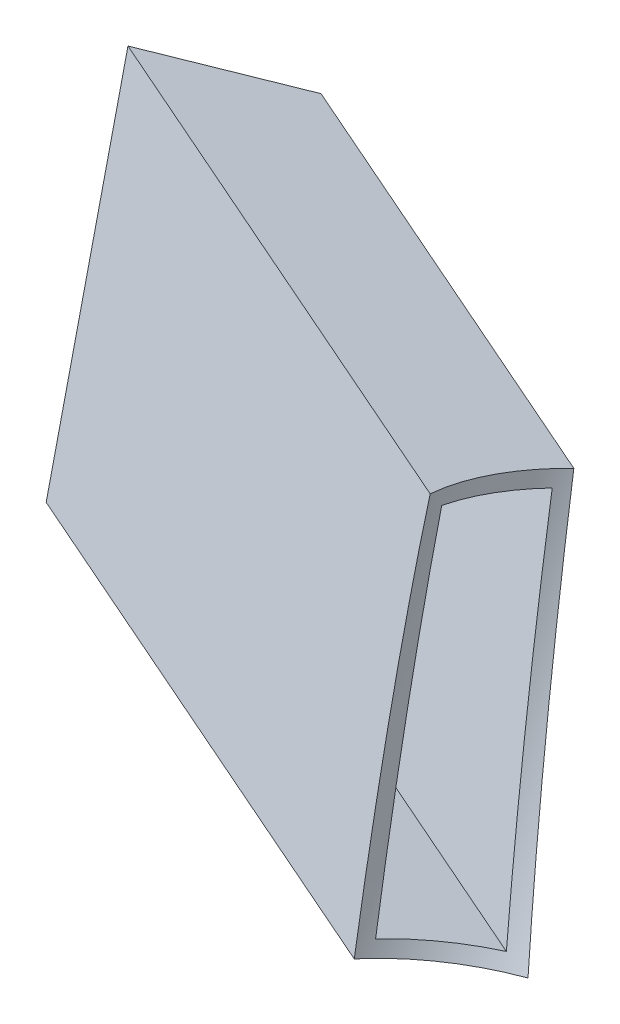
ISO-10303-21;
HEADER;
FILE_DESCRIPTION(('STEP AP214'),'2;1');
FILE_NAME('part.step','',(''),(''),'','','');
FILE_SCHEMA(('AUTOMOTIVE_DESIGN { 1 0 10303 214 1 1 1 1 }'));
ENDSEC;
DATA;
#1=APPLICATION_CONTEXT('core data for automotive mechanical design processes');
#2=APPLICATION_PROTOCOL_DEFINITION('international standard','automotive_design',2000,#1);
#3=PRODUCT_CONTEXT('',#1,'mechanical');
#4=PRODUCT('Part','Part','',(#3));
#5=PRODUCT_RELATED_PRODUCT_CATEGORY('part','',(#4));
#6=PRODUCT_DEFINITION_FORMATION('','',#4);
#7=PRODUCT_DEFINITION_CONTEXT('part definition',#1,'design');
#8=PRODUCT_DEFINITION('design','',#6,#7);
#9=PRODUCT_DEFINITION_SHAPE('','',#8);
#10=(LENGTH_UNIT() NAMED_UNIT(*) SI_UNIT(.MILLI.,.METRE.));
#11=(NAMED_UNIT(*) PLANE_ANGLE_UNIT() SI_UNIT($,.RADIAN.));
#12=(NAMED_UNIT(*) SI_UNIT($,.STERADIAN.) SOLID_ANGLE_UNIT());
#13=UNCERTAINTY_MEASURE_WITH_UNIT(LENGTH_MEASURE(1.E-05),#10,'distance_accuracy_value','');
#14=(GEOMETRIC_REPRESENTATION_CONTEXT(3) GLOBAL_UNCERTAINTY_ASSIGNED_CONTEXT((#13)) GLOBAL_UNIT_ASSIGNED_CONTEXT((#10,
#11,#12)) REPRESENTATION_CONTEXT('',''));
#15=CARTESIAN_POINT('',(0.,0.,0.));
#16=DIRECTION('',(0.,0.,1.));
#17=DIRECTION('',(1.,0.,0.));
#18=AXIS2_PLACEMENT_3D('',#15,#16,#17);
#19=CARTESIAN_POINT('',(-152.700000000018,493.150380334973,267.608142586965));
#20=DIRECTION('',(-0.519686820333577,-0.192188471774973,-0.832459728808773));
#21=DIRECTION('',(-0.848273208946956,0.,0.529558838074519));
#22=AXIS2_PLACEMENT_3D('',#19,#20,#21);
#23=PLANE('',#22);
#24=DIRECTION('',(-0.85435683924902,0.116904098162656,0.506367280796459));
#25=VECTOR('',#24,1.);
#26=CARTESIAN_POINT('',(-69.3047580241468,447.585550535437,226.065744882013));
#27=LINE('',#26,#25);
#28=CARTESIAN_POINT('',(-143.048000000018,457.676049964642,269.77249971909));
#29=VERTEX_POINT('',#28);
#30=CARTESIAN_POINT('',(-162.352000000018,460.317471683599,281.213754168563));
#31=VERTEX_POINT('',#30);
#32=EDGE_CURVE('E49',#29,#31,#27,.T.);
#33=ORIENTED_EDGE('',*,*,#32,.F.);
#34=DIRECTION('',(0.,-0.974370064785232,0.224951054343881));
#35=VECTOR('',#34,1.);
#36=CARTESIAN_POINT('',(-143.048000000018,525.983288986346,254.002531005367));
#37=LINE('',#36,#35);
#38=CARTESIAN_POINT('',(-143.048000000018,525.983288986346,254.002531005367));
#39=VERTEX_POINT('',#38);
#40=EDGE_CURVE('E92',#39,#29,#37,.T.);
#41=ORIENTED_EDGE('',*,*,#40,.F.);
#42=DIRECTION('',(0.85435683924902,-0.116904098162656,-0.506367280796459));
#43=VECTOR('',#42,1.);
#44=CARTESIAN_POINT('',(-69.3047580241468,515.892789557141,210.295776168289));
#45=LINE('',#44,#43);
#46=CARTESIAN_POINT('',(-162.352000000019,528.624710705303,265.443785454839));
#47=VERTEX_POINT('',#46);
#48=EDGE_CURVE('E120',#47,#39,#45,.T.);
#49=ORIENTED_EDGE('',*,*,#48,.F.);
#50=DIRECTION('',(0.,0.974370064785232,-0.224951054343881));
#51=VECTOR('',#50,1.);
#52=CARTESIAN_POINT('',(-162.352000000019,528.624710705303,265.443785454839));
#53=LINE('',#52,#51);
#54=EDGE_CURVE('E99',#31,#47,#53,.T.);
#55=ORIENTED_EDGE('',*,*,#54,.F.);
#56=EDGE_LOOP('',(#33,#41,#49,#55));
#57=FACE_BOUND('',#56,.T.);
#58=DIRECTION('',(0.,0.974370064785232,-0.224951054343881));
#59=VECTOR('',#58,1.);
#60=CARTESIAN_POINT('',(-165.400000000019,532.011657249972,266.564648501642));
#61=LINE('',#60,#59);
#62=CARTESIAN_POINT('',(-165.400000000018,457.764658313338,283.705918842646));
#63=VERTEX_POINT('',#62);
#64=CARTESIAN_POINT('',(-165.400000000019,532.011657249972,266.564648501642));
#65=VERTEX_POINT('',#64);
#66=EDGE_CURVE('E160',#63,#65,#61,.T.);
#67=ORIENTED_EDGE('',*,*,#66,.T.);
#68=DIRECTION('',(0.85435683924902,-0.116904098162656,-0.506367280796459));
#69=VECTOR('',#68,1.);
#70=CARTESIAN_POINT('',(-67.0799447686111,518.558241932043,208.291504625311));
#71=LINE('',#70,#69);
#72=CARTESIAN_POINT('',(-140.000000000018,528.536102356608,251.510366331284));
#73=VERTEX_POINT('',#72);
#74=EDGE_CURVE('E158',#65,#73,#71,.T.);
#75=ORIENTED_EDGE('',*,*,#74,.T.);
#76=DIRECTION('',(0.,-0.974370064785232,0.224951054343881));
#77=VECTOR('',#76,1.);
#78=CARTESIAN_POINT('',(-140.000000000018,528.536102356608,251.510366331284));
#79=LINE('',#78,#77);
#80=CARTESIAN_POINT('',(-140.000000000018,454.289103419973,268.651636672287));
#81=VERTEX_POINT('',#80);
#82=EDGE_CURVE('E156',#73,#81,#79,.T.);
#83=ORIENTED_EDGE('',*,*,#82,.T.);
#84=DIRECTION('',(-0.85435683924902,0.116904098162656,0.506367280796459));
#85=VECTOR('',#84,1.);
#86=CARTESIAN_POINT('',(-67.079944768611,444.311242995409,225.432774966315));
#87=LINE('',#86,#85);
#88=EDGE_CURVE('E132',#81,#63,#87,.T.);
#89=ORIENTED_EDGE('',*,*,#88,.T.);
#90=EDGE_LOOP('',(#67,#75,#83,#89));
#91=FACE_BOUND('',#90,.T.);
#92=ADVANCED_FACE('F40',(#57,#91),#23,.T.);
#93=CARTESIAN_POINT('',(-5.84011046280296,550.599033998661,347.075422454812));
#94=DIRECTION('',(0.459851217543135,-0.199755631603012,-0.865236699040776));
#95=DIRECTION('',(-0.88303358136935,0.,-0.469309806177135));
#96=AXIS2_PLACEMENT_3D('',#93,#94,#95);
#97=PLANE('',#96);
#98=ORIENTED_EDGE('',*,*,#66,.F.);
#99=DIRECTION('',(-0.887995978439146,-0.103444016227646,-0.448065260629072));
#100=VECTOR('',#99,1.);
#101=CARTESIAN_POINT('',(-5.8401104628029,476.352035062027,364.216692795816));
#102=LINE('',#101,#100);
#103=CARTESIAN_POINT('',(-35.0909450628458,472.944560385894,349.457298443914));
#104=VERTEX_POINT('',#103);
#105=EDGE_CURVE('E131',#104,#63,#102,.T.);
#106=ORIENTED_EDGE('',*,*,#105,.F.);
#107=CARTESIAN_POINT('',(-5.5649929109336E-12,468.575510617686,369.115914550578));
#108=DIRECTION('',(0.459851217543135,-0.199755631603012,-0.865236699040776));
#109=DIRECTION('',(-0.123628089728877,0.950479313784053,-0.285140613555112));
#110=AXIS2_PLACEMENT_3D('',#107,#108,#109);
#111=ELLIPSE('',#110,146.750178018489,38.1);
#112=CARTESIAN_POINT('',(-37.5922025299541,546.900183996177,331.053942906455));
#113=VERTEX_POINT('',#112);
#114=EDGE_CURVE('E142',#113,#104,#111,.F.);
#115=ORIENTED_EDGE('',*,*,#114,.F.);
#116=DIRECTION('',(-0.887995978439146,-0.103444016227646,-0.448065260629072));
#117=VECTOR('',#116,1.);
#118=CARTESIAN_POINT('',(-5.84011046280296,550.599033998661,347.075422454812));
#119=LINE('',#118,#117);
#120=EDGE_CURVE('E129',#113,#65,#119,.T.);
#121=ORIENTED_EDGE('',*,*,#120,.T.);
#122=EDGE_LOOP('',(#98,#106,#115,#121));
#123=FACE_BOUND('',#122,.T.);
#124=ADVANCED_FACE('F174',(#123),#97,.F.);
#125=CARTESIAN_POINT('',(5.84011046279274,471.27824201931,342.23968064018));
#126=DIRECTION('',(0.,0.974370064785232,-0.224951054343881));
#127=DIRECTION('',(0.,0.224951054343881,0.974370064785232));
#128=AXIS2_PLACEMENT_3D('',#125,#126,#127);
#129=PLANE('',#128);
#130=ORIENTED_EDGE('',*,*,#88,.F.);
#131=DIRECTION('',(-0.887995978439146,-0.103444016227646,-0.448065260629072));
#132=VECTOR('',#131,1.);
#133=CARTESIAN_POINT('',(5.84011046279274,471.27824201931,342.23968064018));
#134=LINE('',#133,#132);
#135=CARTESIAN_POINT('',(-17.8537114720443,468.518112288734,330.284245302295));
#136=VERTEX_POINT('',#135);
#137=EDGE_CURVE('E134',#136,#81,#134,.T.);
#138=ORIENTED_EDGE('',*,*,#137,.F.);
#139=CARTESIAN_POINT('',(-5.48172618408671E-12,476.43544467188,364.577979508577));
#140=DIRECTION('',(0.,0.974370064785232,-0.224951054343881));
#141=DIRECTION('',(0.,-0.224951054343881,-0.974370064785232));
#142=AXIS2_PLACEMENT_3D('',#139,#140,#141);
#143=ELLIPSE('',#142,39.8408559221603,38.1);
#144=EDGE_CURVE('E147',#104,#136,#143,.F.);
#145=ORIENTED_EDGE('',*,*,#144,.F.);
#146=ORIENTED_EDGE('',*,*,#105,.T.);
#147=EDGE_LOOP('',(#130,#138,#145,#146));
#148=FACE_BOUND('',#147,.T.);
#149=ADVANCED_FACE('F179',(#148),#129,.F.);
#150=CARTESIAN_POINT('',(5.84011046279269,545.525240955945,325.098410299177));
#151=DIRECTION('',(-0.459851217543135,0.199755631603012,0.865236699040776));
#152=DIRECTION('',(0.88303358136935,0.,0.469309806177135));
#153=AXIS2_PLACEMENT_3D('',#150,#151,#152);
#154=PLANE('',#153);
#155=ORIENTED_EDGE('',*,*,#82,.F.);
#156=DIRECTION('',(-0.887995978439146,-0.103444016227646,-0.448065260629072));
#157=VECTOR('',#156,1.);
#158=CARTESIAN_POINT('',(5.84011046279269,545.525240955945,325.098410299177));
#159=LINE('',#158,#157);
#160=CARTESIAN_POINT('',(-33.0725937670595,540.99224023798,305.463827051201));
#161=VERTEX_POINT('',#160);
#162=EDGE_CURVE('E43',#161,#73,#159,.T.);
#163=ORIENTED_EDGE('',*,*,#162,.F.);
#164=CARTESIAN_POINT('',(-4.81559236931162E-12,553.301765400285,320.199188544414));
#165=DIRECTION('',(-0.459851217543135,0.199755631603012,0.865236699040776));
#166=DIRECTION('',(-0.123628089728877,0.950479313784053,-0.285140613555112));
#167=AXIS2_PLACEMENT_3D('',#164,#165,#166);
#168=ELLIPSE('',#167,146.750178018489,38.1);
#169=EDGE_CURVE('E150',#136,#161,#168,.F.);
#170=ORIENTED_EDGE('',*,*,#169,.F.);
#171=ORIENTED_EDGE('',*,*,#137,.T.);
#172=EDGE_LOOP('',(#155,#163,#170,#171));
#173=FACE_BOUND('',#172,.T.);
#174=ADVANCED_FACE('F169',(#173),#154,.F.);
#175=CARTESIAN_POINT('',(5.84011046279269,545.525240955945,325.098410299177));
#176=DIRECTION('',(0.,-0.974370064785232,0.224951054343881));
#177=DIRECTION('',(0.,-0.224951054343881,-0.974370064785232));
#178=AXIS2_PLACEMENT_3D('',#175,#176,#177);
#179=PLANE('',#178);
#180=ORIENTED_EDGE('',*,*,#74,.F.);
#181=ORIENTED_EDGE('',*,*,#120,.F.);
#182=CARTESIAN_POINT('',(-4.8988590961585E-12,545.441831346092,324.737123586416));
#183=DIRECTION('',(0.,-0.974370064785232,0.224951054343881));
#184=DIRECTION('',(0.,-0.224951054343881,-0.974370064785232));
#185=AXIS2_PLACEMENT_3D('',#182,#183,#184);
#186=ELLIPSE('',#185,39.8408559221603,38.1);
#187=EDGE_CURVE('E58',#161,#113,#186,.F.);
#188=ORIENTED_EDGE('',*,*,#187,.F.);
#189=ORIENTED_EDGE('',*,*,#162,.T.);
#190=EDGE_LOOP('',(#180,#181,#188,#189));
#191=FACE_BOUND('',#190,.T.);
#192=ADVANCED_FACE('F171',(#191),#179,.F.);
#193=CARTESIAN_POINT('',(-6.28663787693995E-12,383.632903652674,418.157551547498));
#194=DIRECTION('',(0.,0.866025403784432,-0.500000000000012));
#195=DIRECTION('',(0.,0.500000000000012,0.866025403784432));
#196=AXIS2_PLACEMENT_3D('',#193,#194,#195);
#197=CYLINDRICAL_SURFACE('',#196,38.1);
#198=CARTESIAN_POINT('',(-4.91273688396632E-12,542.681575879123,326.330757823302));
#199=DIRECTION('',(0.,-0.974370064785232,0.22495105434388));
#200=DIRECTION('',(0.,-0.22495105434388,-0.974370064785232));
#201=AXIS2_PLACEMENT_3D('',#198,#199,#200);
#202=ELLIPSE('',#201,39.8408559221603,38.1);
#203=CARTESIAN_POINT('',(-34.0842673910673,538.676641656746,308.983481860981));
#204=VERTEX_POINT('',#203);
#205=CARTESIAN_POINT('',(-38.0576654461079,543.103948756808,328.160255752944));
#206=VERTEX_POINT('',#205);
#207=EDGE_CURVE('E117',#204,#206,#202,.F.);
#208=ORIENTED_EDGE('',*,*,#207,.F.);
#209=CARTESIAN_POINT('',(-4.91273688396632E-12,543.134614826374,326.069195665154));
#210=DIRECTION('',(-0.459851217543135,0.199755631603011,0.865236699040776));
#211=DIRECTION('',(-0.123628089728877,0.950479313784053,-0.285140613555112));
#212=AXIS2_PLACEMENT_3D('',#209,#210,#211);
#213=ELLIPSE('',#212,146.750178018489,38.1);
#214=CARTESIAN_POINT('',(-21.6388010611266,471.819194134389,331.033187476866));
#215=VERTEX_POINT('',#214);
#216=EDGE_CURVE('E109',#215,#204,#213,.F.);
#217=ORIENTED_EDGE('',*,*,#216,.F.);
#218=CARTESIAN_POINT('',(-5.48172618408671E-12,479.195700138848,362.98434527169));
#219=DIRECTION('',(0.,0.974370064785232,-0.22495105434388));
#220=DIRECTION('',(0.,-0.22495105434388,-0.974370064785232));
#221=AXIS2_PLACEMENT_3D('',#218,#219,#220);
#222=ELLIPSE('',#221,39.8408559221603,38.1);
#223=CARTESIAN_POINT('',(-34.200603194895,475.246024844399,345.876422022528));
#224=VERTEX_POINT('',#223);
#225=EDGE_CURVE('E11',#224,#215,#222,.F.);
#226=ORIENTED_EDGE('',*,*,#225,.F.);
#227=CARTESIAN_POINT('',(-5.4678483962789E-12,478.742661191598,363.245907429839));
#228=DIRECTION('',(0.459851217543135,-0.199755631603011,-0.865236699040776));
#229=DIRECTION('',(-0.123628089728877,0.950479313784053,-0.285140613555112));
#230=AXIS2_PLACEMENT_3D('',#227,#228,#229);
#231=ELLIPSE('',#230,146.750178018489,38.1);
#232=EDGE_CURVE('E127',#206,#224,#231,.F.);
#233=ORIENTED_EDGE('',*,*,#232,.F.);
#234=EDGE_LOOP('',(#208,#217,#226,#233));
#235=FACE_BOUND('',#234,.T.);
#236=ORIENTED_EDGE('',*,*,#114,.T.);
#237=ORIENTED_EDGE('',*,*,#144,.T.);
#238=ORIENTED_EDGE('',*,*,#169,.T.);
#239=ORIENTED_EDGE('',*,*,#187,.T.);
#240=EDGE_LOOP('',(#236,#237,#238,#239));
#241=FACE_BOUND('',#240,.T.);
#242=ADVANCED_FACE('F168',(#235,#241),#197,.F.);
#243=CARTESIAN_POINT('',(-4.43848395173148,547.02029887607,345.123831809776));
#244=DIRECTION('',(0.459851217543135,-0.199755631603011,-0.865236699040776));
#245=DIRECTION('',(-0.88303358136935,0.,-0.469309806177135));
#246=AXIS2_PLACEMENT_3D('',#243,#244,#245);
#247=PLANE('',#246);
#248=DIRECTION('',(-0.887995978439146,-0.103444016227646,-0.448065260629072));
#249=VECTOR('',#248,1.);
#250=CARTESIAN_POINT('',(-4.43848395173139,478.713059854366,360.8938005235));
#251=LINE('',#250,#249);
#252=EDGE_CURVE('E123',#224,#31,#251,.T.);
#253=ORIENTED_EDGE('',*,*,#252,.T.);
#254=ORIENTED_EDGE('',*,*,#54,.T.);
#255=DIRECTION('',(-0.887995978439146,-0.103444016227646,-0.448065260629072));
#256=VECTOR('',#255,1.);
#257=CARTESIAN_POINT('',(-4.43848395173148,547.02029887607,345.123831809776));
#258=LINE('',#257,#256);
#259=EDGE_CURVE('E125',#206,#47,#258,.T.);
#260=ORIENTED_EDGE('',*,*,#259,.F.);
#261=ORIENTED_EDGE('',*,*,#232,.T.);
#262=EDGE_LOOP('',(#253,#254,#260,#261));
#263=FACE_BOUND('',#262,.T.);
#264=ADVANCED_FACE('F188',(#263),#247,.T.);
#265=CARTESIAN_POINT('',(4.43848395172119,543.164216163605,328.421302571493));
#266=DIRECTION('',(0.,-0.974370064785232,0.22495105434388));
#267=DIRECTION('',(0.,-0.22495105434388,-0.974370064785232));
#268=AXIS2_PLACEMENT_3D('',#265,#266,#267);
#269=PLANE('',#268);
#270=ORIENTED_EDGE('',*,*,#259,.T.);
#271=ORIENTED_EDGE('',*,*,#48,.T.);
#272=DIRECTION('',(-0.887995978439146,-0.103444016227646,-0.448065260629072));
#273=VECTOR('',#272,1.);
#274=CARTESIAN_POINT('',(4.43848395172119,543.164216163605,328.421302571493));
#275=LINE('',#274,#273);
#276=EDGE_CURVE('E113',#204,#39,#275,.T.);
#277=ORIENTED_EDGE('',*,*,#276,.F.);
#278=ORIENTED_EDGE('',*,*,#207,.T.);
#279=EDGE_LOOP('',(#270,#271,#277,#278));
#280=FACE_BOUND('',#279,.T.);
#281=ADVANCED_FACE('F187',(#280),#269,.T.);
#282=CARTESIAN_POINT('',(4.43848395172119,543.164216163605,328.421302571493));
#283=DIRECTION('',(-0.459851217543135,0.199755631603011,0.865236699040776));
#284=DIRECTION('',(0.88303358136935,0.,0.469309806177135));
#285=AXIS2_PLACEMENT_3D('',#282,#283,#284);
#286=PLANE('',#285);
#287=ORIENTED_EDGE('',*,*,#276,.T.);
#288=ORIENTED_EDGE('',*,*,#40,.T.);
#289=DIRECTION('',(-0.887995978439146,-0.103444016227646,-0.448065260629072));
#290=VECTOR('',#289,1.);
#291=CARTESIAN_POINT('',(4.43848395172126,474.856977141902,344.191271285216));
#292=LINE('',#291,#290);
#293=EDGE_CURVE('E103',#215,#29,#292,.T.);
#294=ORIENTED_EDGE('',*,*,#293,.F.);
#295=ORIENTED_EDGE('',*,*,#216,.T.);
#296=EDGE_LOOP('',(#287,#288,#294,#295));
#297=FACE_BOUND('',#296,.T.);
#298=ADVANCED_FACE('F111',(#297),#286,.T.);
#299=CARTESIAN_POINT('',(4.43848395172126,474.856977141902,344.191271285216));
#300=DIRECTION('',(0.,0.974370064785232,-0.22495105434388));
#301=DIRECTION('',(0.,0.22495105434388,0.974370064785232));
#302=AXIS2_PLACEMENT_3D('',#299,#300,#301);
#303=PLANE('',#302);
#304=ORIENTED_EDGE('',*,*,#293,.T.);
#305=ORIENTED_EDGE('',*,*,#32,.T.);
#306=ORIENTED_EDGE('',*,*,#252,.F.);
#307=ORIENTED_EDGE('',*,*,#225,.T.);
#308=EDGE_LOOP('',(#304,#305,#306,#307));
#309=FACE_BOUND('',#308,.T.);
#310=ADVANCED_FACE('F106',(#309),#303,.T.);
#311=CLOSED_SHELL('',(#92,#124,#149,#174,#192,#242,#264,#281,#298,#310));
#312=MANIFOLD_SOLID_BREP('B2',#311);
#313=ADVANCED_BREP_SHAPE_REPRESENTATION('',(#18,#312),#14);
#314=SHAPE_DEFINITION_REPRESENTATION(#9,#313);
ENDSEC;
END-ISO-10303-21;
